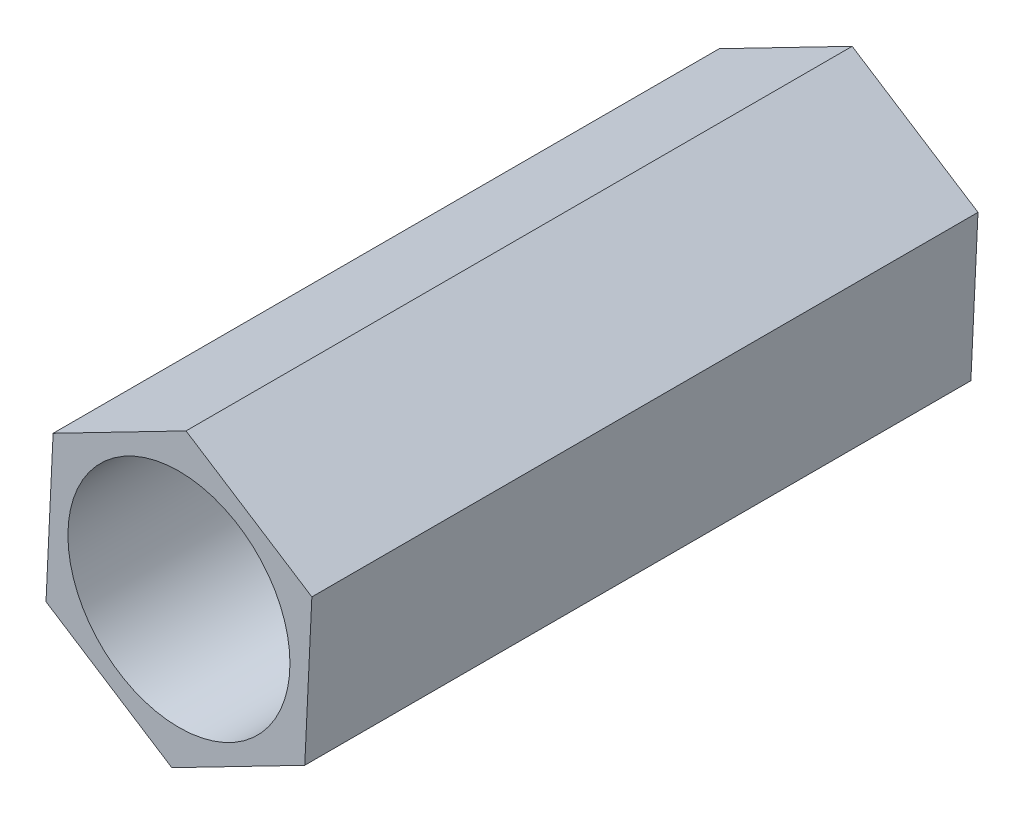
ISO-10303-21;
HEADER;
FILE_DESCRIPTION(('STEP AP214'),'2;1');
FILE_NAME('part.step','',(''),(''),'','','');
FILE_SCHEMA(('AUTOMOTIVE_DESIGN { 1 0 10303 214 1 1 1 1 }'));
ENDSEC;
DATA;
#1=APPLICATION_CONTEXT('core data for automotive mechanical design processes');
#2=APPLICATION_PROTOCOL_DEFINITION('international standard','automotive_design',2000,#1);
#3=PRODUCT_CONTEXT('',#1,'mechanical');
#4=PRODUCT('Part','Part','',(#3));
#5=PRODUCT_RELATED_PRODUCT_CATEGORY('part','',(#4));
#6=PRODUCT_DEFINITION_FORMATION('','',#4);
#7=PRODUCT_DEFINITION_CONTEXT('part definition',#1,'design');
#8=PRODUCT_DEFINITION('design','',#6,#7);
#9=PRODUCT_DEFINITION_SHAPE('','',#8);
#10=(LENGTH_UNIT() NAMED_UNIT(*) SI_UNIT(.MILLI.,.METRE.));
#11=(NAMED_UNIT(*) PLANE_ANGLE_UNIT() SI_UNIT($,.RADIAN.));
#12=(NAMED_UNIT(*) SI_UNIT($,.STERADIAN.) SOLID_ANGLE_UNIT());
#13=UNCERTAINTY_MEASURE_WITH_UNIT(LENGTH_MEASURE(1.E-05),#10,'distance_accuracy_value','');
#14=(GEOMETRIC_REPRESENTATION_CONTEXT(3) GLOBAL_UNCERTAINTY_ASSIGNED_CONTEXT((#13)) GLOBAL_UNIT_ASSIGNED_CONTEXT((#10,
#11,#12)) REPRESENTATION_CONTEXT('',''));
#15=CARTESIAN_POINT('',(0.,0.,0.));
#16=DIRECTION('',(0.,0.,1.));
#17=DIRECTION('',(1.,0.,0.));
#18=AXIS2_PLACEMENT_3D('',#15,#16,#17);
#19=CARTESIAN_POINT('',(-1.79604439642123,-0.926044199494413,-9.));
#20=DIRECTION('',(-0.540596797954986,-0.841281820819168,0.));
#21=DIRECTION('',(0.841281820819169,-0.540596797954987,0.));
#22=AXIS2_PLACEMENT_3D('',#19,#20,#21);
#23=PLANE('',#22);
#24=DIRECTION('',(0.841281820819169,-0.540596797954987,0.));
#25=VECTOR('',#24,1.);
#26=CARTESIAN_POINT('',(-1.79604439642123,-0.926044199494413,0.));
#27=LINE('',#26,#25);
#28=CARTESIAN_POINT('',(-1.79604439642123,-0.926044199494413,0.));
#29=VERTEX_POINT('',#28);
#30=CARTESIAN_POINT('',(-0.0960443964212261,-2.01844217337268,0.));
#31=VERTEX_POINT('',#30);
#32=EDGE_CURVE('E127',#29,#31,#27,.T.);
#33=ORIENTED_EDGE('',*,*,#32,.F.);
#34=DIRECTION('',(0.,0.,1.));
#35=VECTOR('',#34,1.);
#36=CARTESIAN_POINT('',(-1.79604439642123,-0.926044199494413,-9.));
#37=LINE('',#36,#35);
#38=CARTESIAN_POINT('',(-1.79604439642123,-0.926044199494413,-9.));
#39=VERTEX_POINT('',#38);
#40=EDGE_CURVE('E11',#39,#29,#37,.T.);
#41=ORIENTED_EDGE('',*,*,#40,.F.);
#42=DIRECTION('',(0.841281820819169,-0.540596797954987,0.));
#43=VECTOR('',#42,1.);
#44=CARTESIAN_POINT('',(-1.79604439642123,-0.926044199494413,-9.));
#45=LINE('',#44,#43);
#46=CARTESIAN_POINT('',(-0.0960443964212261,-2.01844217337268,-9.));
#47=VERTEX_POINT('',#46);
#48=EDGE_CURVE('E142',#39,#47,#45,.T.);
#49=ORIENTED_EDGE('',*,*,#48,.T.);
#50=DIRECTION('',(0.,0.,1.));
#51=VECTOR('',#50,1.);
#52=CARTESIAN_POINT('',(-0.0960443964212261,-2.01844217337268,-9.));
#53=LINE('',#52,#51);
#54=EDGE_CURVE('E45',#47,#31,#53,.T.);
#55=ORIENTED_EDGE('',*,*,#54,.T.);
#56=EDGE_LOOP('',(#33,#41,#49,#55));
#57=FACE_BOUND('',#56,.T.);
#58=ADVANCED_FACE('F42',(#57),#23,.T.);
#59=CARTESIAN_POINT('',(-1.7,1.09239797387826,-9.));
#60=DIRECTION('',(-0.998869827548921,0.0475296498239572,0.));
#61=DIRECTION('',(-0.0475296498239572,-0.998869827548921,0.));
#62=AXIS2_PLACEMENT_3D('',#59,#60,#61);
#63=PLANE('',#62);
#64=DIRECTION('',(-0.0475296498239572,-0.998869827548921,0.));
#65=VECTOR('',#64,1.);
#66=CARTESIAN_POINT('',(-1.7,1.09239797387826,0.));
#67=LINE('',#66,#65);
#68=CARTESIAN_POINT('',(-1.7,1.09239797387826,0.));
#69=VERTEX_POINT('',#68);
#70=EDGE_CURVE('E140',#69,#29,#67,.T.);
#71=ORIENTED_EDGE('',*,*,#70,.F.);
#72=DIRECTION('',(0.,0.,1.));
#73=VECTOR('',#72,1.);
#74=CARTESIAN_POINT('',(-1.7,1.09239797387826,-9.));
#75=LINE('',#74,#73);
#76=CARTESIAN_POINT('',(-1.7,1.09239797387826,-9.));
#77=VERTEX_POINT('',#76);
#78=EDGE_CURVE('E51',#77,#69,#75,.T.);
#79=ORIENTED_EDGE('',*,*,#78,.F.);
#80=DIRECTION('',(-0.0475296498239572,-0.998869827548921,0.));
#81=VECTOR('',#80,1.);
#82=CARTESIAN_POINT('',(-1.7,1.09239797387826,-9.));
#83=LINE('',#82,#81);
#84=EDGE_CURVE('E117',#77,#39,#83,.T.);
#85=ORIENTED_EDGE('',*,*,#84,.T.);
#86=ORIENTED_EDGE('',*,*,#40,.T.);
#87=EDGE_LOOP('',(#71,#79,#85,#86));
#88=FACE_BOUND('',#87,.T.);
#89=ADVANCED_FACE('F150',(#88),#63,.T.);
#90=CARTESIAN_POINT('',(0.0960443964212259,2.01844217337268,-9.));
#91=DIRECTION('',(-0.458273029593935,0.888811470643126,0.));
#92=DIRECTION('',(-0.888811470643126,-0.458273029593935,0.));
#93=AXIS2_PLACEMENT_3D('',#90,#91,#92);
#94=PLANE('',#93);
#95=DIRECTION('',(-0.888811470643126,-0.458273029593935,0.));
#96=VECTOR('',#95,1.);
#97=CARTESIAN_POINT('',(0.0960443964212259,2.01844217337268,0.));
#98=LINE('',#97,#96);
#99=CARTESIAN_POINT('',(0.0960443964212259,2.01844217337268,0.));
#100=VERTEX_POINT('',#99);
#101=EDGE_CURVE('E104',#100,#69,#98,.T.);
#102=ORIENTED_EDGE('',*,*,#101,.F.);
#103=DIRECTION('',(0.,0.,1.));
#104=VECTOR('',#103,1.);
#105=CARTESIAN_POINT('',(0.0960443964212259,2.01844217337268,-9.));
#106=LINE('',#105,#104);
#107=CARTESIAN_POINT('',(0.0960443964212259,2.01844217337268,-9.));
#108=VERTEX_POINT('',#107);
#109=EDGE_CURVE('E99',#108,#100,#106,.T.);
#110=ORIENTED_EDGE('',*,*,#109,.F.);
#111=DIRECTION('',(-0.888811470643126,-0.458273029593935,0.));
#112=VECTOR('',#111,1.);
#113=CARTESIAN_POINT('',(0.0960443964212259,2.01844217337268,-9.));
#114=LINE('',#113,#112);
#115=EDGE_CURVE('E102',#108,#77,#114,.T.);
#116=ORIENTED_EDGE('',*,*,#115,.T.);
#117=ORIENTED_EDGE('',*,*,#78,.T.);
#118=EDGE_LOOP('',(#102,#110,#116,#117));
#119=FACE_BOUND('',#118,.T.);
#120=ADVANCED_FACE('F101',(#119),#94,.T.);
#121=CARTESIAN_POINT('',(1.79604439642123,0.926044199494413,-9.));
#122=DIRECTION('',(0.540596797954986,0.841281820819169,0.));
#123=DIRECTION('',(-0.841281820819169,0.540596797954986,0.));
#124=AXIS2_PLACEMENT_3D('',#121,#122,#123);
#125=PLANE('',#124);
#126=DIRECTION('',(-0.841281820819169,0.540596797954986,0.));
#127=VECTOR('',#126,1.);
#128=CARTESIAN_POINT('',(1.79604439642123,0.926044199494413,0.));
#129=LINE('',#128,#127);
#130=CARTESIAN_POINT('',(1.79604439642123,0.926044199494413,0.));
#131=VERTEX_POINT('',#130);
#132=EDGE_CURVE('E137',#131,#100,#129,.T.);
#133=ORIENTED_EDGE('',*,*,#132,.F.);
#134=DIRECTION('',(0.,0.,1.));
#135=VECTOR('',#134,1.);
#136=CARTESIAN_POINT('',(1.79604439642123,0.926044199494413,-9.));
#137=LINE('',#136,#135);
#138=CARTESIAN_POINT('',(1.79604439642123,0.926044199494413,-9.));
#139=VERTEX_POINT('',#138);
#140=EDGE_CURVE('E109',#139,#131,#137,.T.);
#141=ORIENTED_EDGE('',*,*,#140,.F.);
#142=DIRECTION('',(-0.841281820819169,0.540596797954986,0.));
#143=VECTOR('',#142,1.);
#144=CARTESIAN_POINT('',(1.79604439642123,0.926044199494413,-9.));
#145=LINE('',#144,#143);
#146=EDGE_CURVE('E115',#139,#108,#145,.T.);
#147=ORIENTED_EDGE('',*,*,#146,.T.);
#148=ORIENTED_EDGE('',*,*,#109,.T.);
#149=EDGE_LOOP('',(#133,#141,#147,#148));
#150=FACE_BOUND('',#149,.T.);
#151=ADVANCED_FACE('F119',(#150),#125,.T.);
#152=CARTESIAN_POINT('',(1.7,-1.09239797387826,-9.));
#153=DIRECTION('',(0.998869827548921,-0.0475296498239572,0.));
#154=DIRECTION('',(0.0475296498239572,0.998869827548921,0.));
#155=AXIS2_PLACEMENT_3D('',#152,#153,#154);
#156=PLANE('',#155);
#157=DIRECTION('',(0.0475296498239572,0.998869827548922,0.));
#158=VECTOR('',#157,1.);
#159=CARTESIAN_POINT('',(1.7,-1.09239797387826,0.));
#160=LINE('',#159,#158);
#161=CARTESIAN_POINT('',(1.7,-1.09239797387826,0.));
#162=VERTEX_POINT('',#161);
#163=EDGE_CURVE('E134',#162,#131,#160,.T.);
#164=ORIENTED_EDGE('',*,*,#163,.F.);
#165=DIRECTION('',(0.,0.,1.));
#166=VECTOR('',#165,1.);
#167=CARTESIAN_POINT('',(1.7,-1.09239797387826,-9.));
#168=LINE('',#167,#166);
#169=CARTESIAN_POINT('',(1.7,-1.09239797387826,-9.));
#170=VERTEX_POINT('',#169);
#171=EDGE_CURVE('E145',#170,#162,#168,.T.);
#172=ORIENTED_EDGE('',*,*,#171,.F.);
#173=DIRECTION('',(0.0475296498239572,0.998869827548922,0.));
#174=VECTOR('',#173,1.);
#175=CARTESIAN_POINT('',(1.7,-1.09239797387826,-9.));
#176=LINE('',#175,#174);
#177=EDGE_CURVE('E120',#170,#139,#176,.T.);
#178=ORIENTED_EDGE('',*,*,#177,.T.);
#179=ORIENTED_EDGE('',*,*,#140,.T.);
#180=EDGE_LOOP('',(#164,#172,#178,#179));
#181=FACE_BOUND('',#180,.T.);
#182=ADVANCED_FACE('F163',(#181),#156,.T.);
#183=CARTESIAN_POINT('',(-0.0960443964212261,-2.01844217337268,-9.));
#184=DIRECTION('',(0.458273029593935,-0.888811470643126,0.));
#185=DIRECTION('',(0.888811470643126,0.458273029593935,0.));
#186=AXIS2_PLACEMENT_3D('',#183,#184,#185);
#187=PLANE('',#186);
#188=DIRECTION('',(0.888811470643126,0.458273029593936,0.));
#189=VECTOR('',#188,1.);
#190=CARTESIAN_POINT('',(-0.0960443964212261,-2.01844217337268,0.));
#191=LINE('',#190,#189);
#192=EDGE_CURVE('E130',#31,#162,#191,.T.);
#193=ORIENTED_EDGE('',*,*,#192,.F.);
#194=ORIENTED_EDGE('',*,*,#54,.F.);
#195=DIRECTION('',(0.888811470643126,0.458273029593936,0.));
#196=VECTOR('',#195,1.);
#197=CARTESIAN_POINT('',(-0.0960443964212261,-2.01844217337268,-9.));
#198=LINE('',#197,#196);
#199=EDGE_CURVE('E122',#47,#170,#198,.T.);
#200=ORIENTED_EDGE('',*,*,#199,.T.);
#201=ORIENTED_EDGE('',*,*,#171,.T.);
#202=EDGE_LOOP('',(#193,#194,#200,#201));
#203=FACE_BOUND('',#202,.T.);
#204=ADVANCED_FACE('F147',(#203),#187,.T.);
#205=CARTESIAN_POINT('',(0.,0.,-9.));
#206=DIRECTION('',(0.,0.,1.));
#207=DIRECTION('',(1.,0.,0.));
#208=AXIS2_PLACEMENT_3D('',#205,#206,#207);
#209=PLANE('',#208);
#210=CARTESIAN_POINT('',(0.,0.,-9.));
#211=DIRECTION('',(0.,0.,1.));
#212=DIRECTION('',(1.,0.,0.));
#213=AXIS2_PLACEMENT_3D('',#210,#211,#212);
#214=CIRCLE('',#213,1.5);
#215=CARTESIAN_POINT('',(1.5,0.,-9.));
#216=VERTEX_POINT('',#215);
#217=EDGE_CURVE('E131',#216,#216,#214,.T.);
#218=ORIENTED_EDGE('',*,*,#217,.T.);
#219=EDGE_LOOP('',(#218));
#220=FACE_BOUND('',#219,.T.);
#221=ORIENTED_EDGE('',*,*,#48,.F.);
#222=ORIENTED_EDGE('',*,*,#84,.F.);
#223=ORIENTED_EDGE('',*,*,#115,.F.);
#224=ORIENTED_EDGE('',*,*,#146,.F.);
#225=ORIENTED_EDGE('',*,*,#177,.F.);
#226=ORIENTED_EDGE('',*,*,#199,.F.);
#227=EDGE_LOOP('',(#221,#222,#223,#224,#225,#226));
#228=FACE_BOUND('',#227,.T.);
#229=ADVANCED_FACE('F113',(#220,#228),#209,.F.);
#230=CARTESIAN_POINT('',(0.,0.,0.));
#231=DIRECTION('',(0.,0.,1.));
#232=DIRECTION('',(1.,0.,0.));
#233=AXIS2_PLACEMENT_3D('',#230,#231,#232);
#234=PLANE('',#233);
#235=CARTESIAN_POINT('',(0.,0.,0.));
#236=DIRECTION('',(0.,0.,1.));
#237=DIRECTION('',(1.,0.,0.));
#238=AXIS2_PLACEMENT_3D('',#235,#236,#237);
#239=CIRCLE('',#238,1.5);
#240=CARTESIAN_POINT('',(1.5,0.,0.));
#241=VERTEX_POINT('',#240);
#242=EDGE_CURVE('E185',#241,#241,#239,.T.);
#243=ORIENTED_EDGE('',*,*,#242,.F.);
#244=EDGE_LOOP('',(#243));
#245=FACE_BOUND('',#244,.T.);
#246=ORIENTED_EDGE('',*,*,#32,.T.);
#247=ORIENTED_EDGE('',*,*,#192,.T.);
#248=ORIENTED_EDGE('',*,*,#163,.T.);
#249=ORIENTED_EDGE('',*,*,#132,.T.);
#250=ORIENTED_EDGE('',*,*,#101,.T.);
#251=ORIENTED_EDGE('',*,*,#70,.T.);
#252=EDGE_LOOP('',(#246,#247,#248,#249,#250,#251));
#253=FACE_BOUND('',#252,.T.);
#254=ADVANCED_FACE('F149',(#245,#253),#234,.T.);
#255=CARTESIAN_POINT('',(0.,0.,-9.));
#256=DIRECTION('',(0.,0.,1.));
#257=DIRECTION('',(1.,0.,0.));
#258=AXIS2_PLACEMENT_3D('',#255,#256,#257);
#259=CYLINDRICAL_SURFACE('',#258,1.5);
#260=ORIENTED_EDGE('',*,*,#217,.F.);
#261=EDGE_LOOP('',(#260));
#262=FACE_BOUND('',#261,.T.);
#263=ORIENTED_EDGE('',*,*,#242,.T.);
#264=EDGE_LOOP('',(#263));
#265=FACE_BOUND('',#264,.T.);
#266=ADVANCED_FACE('F174',(#262,#265),#259,.F.);
#267=CLOSED_SHELL('',(#58,#89,#120,#151,#182,#204,#229,#254,#266));
#268=MANIFOLD_SOLID_BREP('B2',#267);
#269=ADVANCED_BREP_SHAPE_REPRESENTATION('',(#18,#268),#14);
#270=SHAPE_DEFINITION_REPRESENTATION(#9,#269);
ENDSEC;
END-ISO-10303-21;
